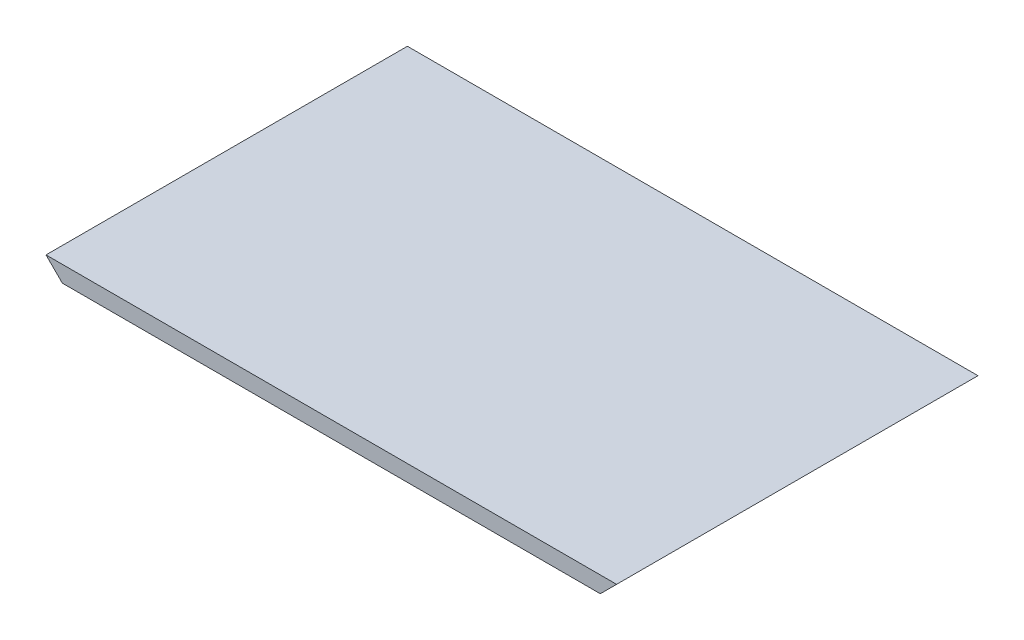
ISO-10303-21;
HEADER;
FILE_DESCRIPTION(('STEP AP214'),'2;1');
FILE_NAME('part.step','',(''),(''),'','','');
FILE_SCHEMA(('AUTOMOTIVE_DESIGN { 1 0 10303 214 1 1 1 1 }'));
ENDSEC;
DATA;
#1=APPLICATION_CONTEXT('core data for automotive mechanical design processes');
#2=APPLICATION_PROTOCOL_DEFINITION('international standard','automotive_design',2000,#1);
#3=PRODUCT_CONTEXT('',#1,'mechanical');
#4=PRODUCT('Part','Part','',(#3));
#5=PRODUCT_RELATED_PRODUCT_CATEGORY('part','',(#4));
#6=PRODUCT_DEFINITION_FORMATION('','',#4);
#7=PRODUCT_DEFINITION_CONTEXT('part definition',#1,'design');
#8=PRODUCT_DEFINITION('design','',#6,#7);
#9=PRODUCT_DEFINITION_SHAPE('','',#8);
#10=(LENGTH_UNIT() NAMED_UNIT(*) SI_UNIT(.MILLI.,.METRE.));
#11=(NAMED_UNIT(*) PLANE_ANGLE_UNIT() SI_UNIT($,.RADIAN.));
#12=(NAMED_UNIT(*) SI_UNIT($,.STERADIAN.) SOLID_ANGLE_UNIT());
#13=UNCERTAINTY_MEASURE_WITH_UNIT(LENGTH_MEASURE(1.E-05),#10,'distance_accuracy_value','');
#14=(GEOMETRIC_REPRESENTATION_CONTEXT(3) GLOBAL_UNCERTAINTY_ASSIGNED_CONTEXT((#13)) GLOBAL_UNIT_ASSIGNED_CONTEXT((#10,
#11,#12)) REPRESENTATION_CONTEXT('',''));
#15=CARTESIAN_POINT('',(0.,0.,0.));
#16=DIRECTION('',(0.,0.,1.));
#17=DIRECTION('',(1.,0.,0.));
#18=AXIS2_PLACEMENT_3D('',#15,#16,#17);
#19=CARTESIAN_POINT('',(-105.,6.,66.5));
#20=DIRECTION('',(0.,0.,-1.));
#21=DIRECTION('',(-1.,0.,0.));
#22=AXIS2_PLACEMENT_3D('',#19,#20,#21);
#23=PLANE('',#22);
#24=DIRECTION('',(1.,0.,0.));
#25=VECTOR('',#24,1.);
#26=CARTESIAN_POINT('',(-105.,6.,66.5));
#27=LINE('',#26,#25);
#28=CARTESIAN_POINT('',(-105.,6.,66.5));
#29=VERTEX_POINT('',#28);
#30=CARTESIAN_POINT('',(105.,6.,66.5));
#31=VERTEX_POINT('',#30);
#32=EDGE_CURVE('E83',#29,#31,#27,.T.);
#33=ORIENTED_EDGE('',*,*,#32,.F.);
#34=DIRECTION('',(0.707106781186548,-0.707106781186547,0.));
#35=VECTOR('',#34,1.);
#36=CARTESIAN_POINT('',(-99.,0.,66.5));
#37=LINE('',#36,#35);
#38=CARTESIAN_POINT('',(-99.,0.,66.5));
#39=VERTEX_POINT('',#38);
#40=EDGE_CURVE('E11',#29,#39,#37,.T.);
#41=ORIENTED_EDGE('',*,*,#40,.T.);
#42=DIRECTION('',(1.,0.,0.));
#43=VECTOR('',#42,1.);
#44=CARTESIAN_POINT('',(-105.,0.,66.5));
#45=LINE('',#44,#43);
#46=CARTESIAN_POINT('',(99.,0.,66.5));
#47=VERTEX_POINT('',#46);
#48=EDGE_CURVE('E86',#39,#47,#45,.T.);
#49=ORIENTED_EDGE('',*,*,#48,.T.);
#50=DIRECTION('',(-0.707106781186549,-0.707106781186546,0.));
#51=VECTOR('',#50,1.);
#52=CARTESIAN_POINT('',(105.,6.,66.5));
#53=LINE('',#52,#51);
#54=EDGE_CURVE('E48',#47,#31,#53,.F.);
#55=ORIENTED_EDGE('',*,*,#54,.T.);
#56=EDGE_LOOP('',(#33,#41,#49,#55));
#57=FACE_BOUND('',#56,.T.);
#58=ADVANCED_FACE('F39',(#57),#23,.F.);
#59=CARTESIAN_POINT('',(-105.,6.,-66.4999999999999));
#60=DIRECTION('',(0.,0.,-1.));
#61=DIRECTION('',(-1.,0.,0.));
#62=AXIS2_PLACEMENT_3D('',#59,#60,#61);
#63=PLANE('',#62);
#64=DIRECTION('',(1.,0.,0.));
#65=VECTOR('',#64,1.);
#66=CARTESIAN_POINT('',(-105.,0.,-66.4999999999999));
#67=LINE('',#66,#65);
#68=CARTESIAN_POINT('',(-99.,0.,-66.4999999999999));
#69=VERTEX_POINT('',#68);
#70=CARTESIAN_POINT('',(99.,0.,-66.5));
#71=VERTEX_POINT('',#70);
#72=EDGE_CURVE('E99',#69,#71,#67,.T.);
#73=ORIENTED_EDGE('',*,*,#72,.F.);
#74=DIRECTION('',(-0.707106781186548,0.707106781186547,0.));
#75=VECTOR('',#74,1.);
#76=CARTESIAN_POINT('',(-105.,6.,-66.4999999999999));
#77=LINE('',#76,#75);
#78=CARTESIAN_POINT('',(-105.,6.,-66.4999999999999));
#79=VERTEX_POINT('',#78);
#80=EDGE_CURVE('E63',#69,#79,#77,.T.);
#81=ORIENTED_EDGE('',*,*,#80,.T.);
#82=DIRECTION('',(1.,0.,0.));
#83=VECTOR('',#82,1.);
#84=CARTESIAN_POINT('',(-105.,6.,-66.4999999999999));
#85=LINE('',#84,#83);
#86=CARTESIAN_POINT('',(105.,6.,-66.5));
#87=VERTEX_POINT('',#86);
#88=EDGE_CURVE('E102',#79,#87,#85,.T.);
#89=ORIENTED_EDGE('',*,*,#88,.T.);
#90=DIRECTION('',(0.707106781186549,0.707106781186546,0.));
#91=VECTOR('',#90,1.);
#92=CARTESIAN_POINT('',(-5.82867087928207E-13,-99.,-66.5));
#93=LINE('',#92,#91);
#94=EDGE_CURVE('E55',#87,#71,#93,.F.);
#95=ORIENTED_EDGE('',*,*,#94,.T.);
#96=EDGE_LOOP('',(#73,#81,#89,#95));
#97=FACE_BOUND('',#96,.T.);
#98=ADVANCED_FACE('F122',(#97),#63,.T.);
#99=CARTESIAN_POINT('',(0.,6.,0.));
#100=DIRECTION('',(0.,1.,0.));
#101=DIRECTION('',(0.,0.,1.));
#102=AXIS2_PLACEMENT_3D('',#99,#100,#101);
#103=PLANE('',#102);
#104=ORIENTED_EDGE('',*,*,#32,.T.);
#105=DIRECTION('',(0.,0.,-1.));
#106=VECTOR('',#105,1.);
#107=CARTESIAN_POINT('',(105.,6.,66.5));
#108=LINE('',#107,#106);
#109=EDGE_CURVE('E95',#31,#87,#108,.T.);
#110=ORIENTED_EDGE('',*,*,#109,.T.);
#111=ORIENTED_EDGE('',*,*,#88,.F.);
#112=DIRECTION('',(0.,0.,-1.));
#113=VECTOR('',#112,1.);
#114=CARTESIAN_POINT('',(-105.,6.,66.5));
#115=LINE('',#114,#113);
#116=EDGE_CURVE('E96',#29,#79,#115,.T.);
#117=ORIENTED_EDGE('',*,*,#116,.F.);
#118=EDGE_LOOP('',(#104,#110,#111,#117));
#119=FACE_BOUND('',#118,.T.);
#120=ADVANCED_FACE('F93',(#119),#103,.T.);
#121=CARTESIAN_POINT('',(0.,0.,0.));
#122=DIRECTION('',(0.,1.,0.));
#123=DIRECTION('',(0.,0.,1.));
#124=AXIS2_PLACEMENT_3D('',#121,#122,#123);
#125=PLANE('',#124);
#126=ORIENTED_EDGE('',*,*,#48,.F.);
#127=DIRECTION('',(0.,0.,-1.));
#128=VECTOR('',#127,1.);
#129=CARTESIAN_POINT('',(-99.,0.,-66.4999999999999));
#130=LINE('',#129,#128);
#131=EDGE_CURVE('E116',#39,#69,#130,.T.);
#132=ORIENTED_EDGE('',*,*,#131,.T.);
#133=ORIENTED_EDGE('',*,*,#72,.T.);
#134=DIRECTION('',(0.,0.,1.));
#135=VECTOR('',#134,1.);
#136=CARTESIAN_POINT('',(99.,0.,0.));
#137=LINE('',#136,#135);
#138=EDGE_CURVE('E109',#71,#47,#137,.T.);
#139=ORIENTED_EDGE('',*,*,#138,.T.);
#140=EDGE_LOOP('',(#126,#132,#133,#139));
#141=FACE_BOUND('',#140,.T.);
#142=ADVANCED_FACE('F125',(#141),#125,.F.);
#143=CARTESIAN_POINT('',(-99.,0.,0.));
#144=DIRECTION('',(-0.707106781186547,-0.707106781186548,0.));
#145=DIRECTION('',(0.,0.,1.));
#146=AXIS2_PLACEMENT_3D('',#143,#144,#145);
#147=PLANE('',#146);
#148=ORIENTED_EDGE('',*,*,#40,.F.);
#149=ORIENTED_EDGE('',*,*,#116,.T.);
#150=ORIENTED_EDGE('',*,*,#80,.F.);
#151=ORIENTED_EDGE('',*,*,#131,.F.);
#152=EDGE_LOOP('',(#148,#149,#150,#151));
#153=FACE_BOUND('',#152,.T.);
#154=ADVANCED_FACE('F123',(#153),#147,.T.);
#155=CARTESIAN_POINT('',(105.,6.,66.5));
#156=DIRECTION('',(-0.707106781186546,0.707106781186549,0.));
#157=DIRECTION('',(0.,0.,-1.));
#158=AXIS2_PLACEMENT_3D('',#155,#156,#157);
#159=PLANE('',#158);
#160=ORIENTED_EDGE('',*,*,#54,.F.);
#161=ORIENTED_EDGE('',*,*,#138,.F.);
#162=ORIENTED_EDGE('',*,*,#94,.F.);
#163=ORIENTED_EDGE('',*,*,#109,.F.);
#164=EDGE_LOOP('',(#160,#161,#162,#163));
#165=FACE_BOUND('',#164,.T.);
#166=ADVANCED_FACE('F41',(#165),#159,.F.);
#167=CLOSED_SHELL('',(#58,#98,#120,#142,#154,#166));
#168=MANIFOLD_SOLID_BREP('B2',#167);
#169=ADVANCED_BREP_SHAPE_REPRESENTATION('',(#18,#168),#14);
#170=SHAPE_DEFINITION_REPRESENTATION(#9,#169);
ENDSEC;
END-ISO-10303-21;
